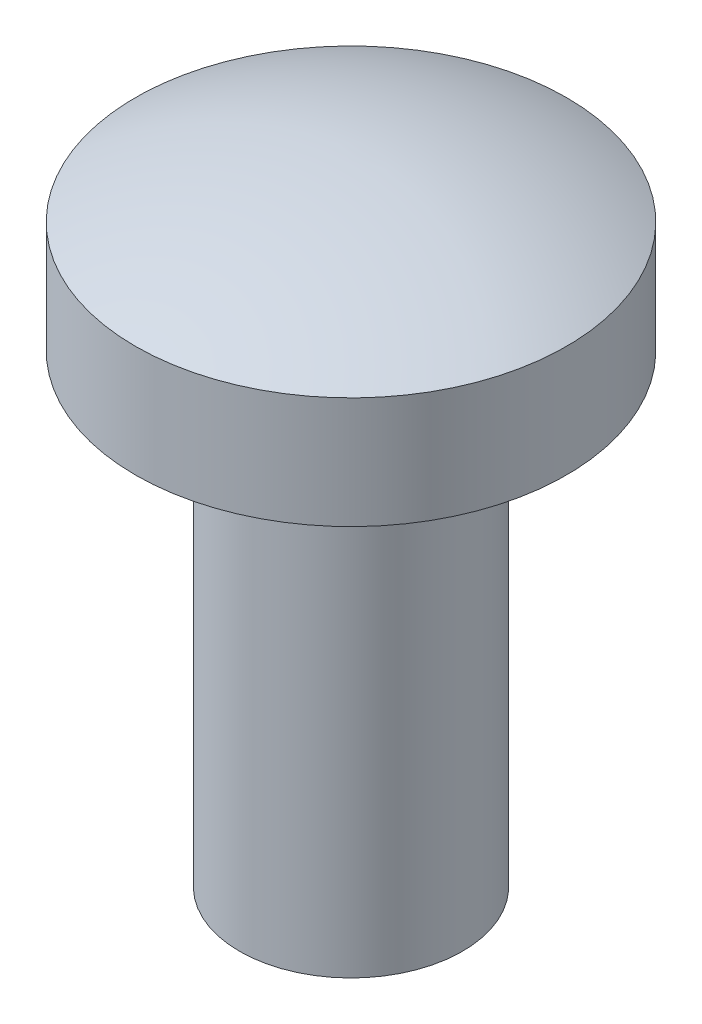
ISO-10303-21;
HEADER;
FILE_DESCRIPTION(('STEP AP214'),'2;1');
FILE_NAME('part.step','',(''),(''),'','','');
FILE_SCHEMA(('AUTOMOTIVE_DESIGN { 1 0 10303 214 1 1 1 1 }'));
ENDSEC;
DATA;
#1=APPLICATION_CONTEXT('core data for automotive mechanical design processes');
#2=APPLICATION_PROTOCOL_DEFINITION('international standard','automotive_design',2000,#1);
#3=PRODUCT_CONTEXT('',#1,'mechanical');
#4=PRODUCT('Part','Part','',(#3));
#5=PRODUCT_RELATED_PRODUCT_CATEGORY('part','',(#4));
#6=PRODUCT_DEFINITION_FORMATION('','',#4);
#7=PRODUCT_DEFINITION_CONTEXT('part definition',#1,'design');
#8=PRODUCT_DEFINITION('design','',#6,#7);
#9=PRODUCT_DEFINITION_SHAPE('','',#8);
#10=(LENGTH_UNIT() NAMED_UNIT(*) SI_UNIT(.MILLI.,.METRE.));
#11=(NAMED_UNIT(*) PLANE_ANGLE_UNIT() SI_UNIT($,.RADIAN.));
#12=(NAMED_UNIT(*) SI_UNIT($,.STERADIAN.) SOLID_ANGLE_UNIT());
#13=UNCERTAINTY_MEASURE_WITH_UNIT(LENGTH_MEASURE(1.E-05),#10,'distance_accuracy_value','');
#14=(GEOMETRIC_REPRESENTATION_CONTEXT(3) GLOBAL_UNCERTAINTY_ASSIGNED_CONTEXT((#13)) GLOBAL_UNIT_ASSIGNED_CONTEXT((#10,
#11,#12)) REPRESENTATION_CONTEXT('',''));
#15=CARTESIAN_POINT('',(0.,0.,0.));
#16=DIRECTION('',(0.,0.,1.));
#17=DIRECTION('',(1.,0.,0.));
#18=AXIS2_PLACEMENT_3D('',#15,#16,#17);
#19=CARTESIAN_POINT('',(0.,-3.175,0.));
#20=DIRECTION('',(0.,1.,0.));
#21=DIRECTION('',(0.,0.,1.));
#22=AXIS2_PLACEMENT_3D('',#19,#20,#21);
#23=PLANE('',#22);
#24=CARTESIAN_POINT('',(0.,-3.175,0.));
#25=DIRECTION('',(0.,1.,0.));
#26=DIRECTION('',(0.,0.,1.));
#27=AXIS2_PLACEMENT_3D('',#24,#25,#26);
#28=CIRCLE('',#27,0.761999999999996);
#29=CARTESIAN_POINT('',(0.,-3.175,0.761999999999983));
#30=VERTEX_POINT('',#29);
#31=EDGE_CURVE('E10',#30,#30,#28,.T.);
#32=ORIENTED_EDGE('',*,*,#31,.F.);
#33=EDGE_LOOP('',(#32));
#34=FACE_BOUND('',#33,.T.);
#35=ADVANCED_FACE('F30',(#34),#23,.F.);
#36=CARTESIAN_POINT('',(0.,64.9077037109984,0.));
#37=DIRECTION('',(0.,1.,0.));
#38=DIRECTION('',(0.,0.,1.));
#39=AXIS2_PLACEMENT_3D('',#36,#37,#38);
#40=CYLINDRICAL_SURFACE('',#39,0.761999999999996);
#41=CARTESIAN_POINT('',(0.,0.,0.));
#42=DIRECTION('',(0.,1.,0.));
#43=DIRECTION('',(0.,0.,1.));
#44=AXIS2_PLACEMENT_3D('',#41,#42,#43);
#45=CIRCLE('',#44,0.761999999999996);
#46=CARTESIAN_POINT('',(0.,0.,0.761999999999984));
#47=VERTEX_POINT('',#46);
#48=EDGE_CURVE('E36',#47,#47,#45,.T.);
#49=ORIENTED_EDGE('',*,*,#48,.F.);
#50=EDGE_LOOP('',(#49));
#51=FACE_BOUND('',#50,.T.);
#52=ORIENTED_EDGE('',*,*,#31,.T.);
#53=EDGE_LOOP('',(#52));
#54=FACE_BOUND('',#53,.T.);
#55=ADVANCED_FACE('F60',(#51,#54),#40,.T.);
#56=CARTESIAN_POINT('',(0.,0.,-0.762000000000008));
#57=DIRECTION('',(0.,1.,0.));
#58=DIRECTION('',(0.,0.,1.));
#59=AXIS2_PLACEMENT_3D('',#56,#57,#58);
#60=PLANE('',#59);
#61=CARTESIAN_POINT('',(0.,0.,0.));
#62=DIRECTION('',(0.,1.,0.));
#63=DIRECTION('',(0.,0.,1.));
#64=AXIS2_PLACEMENT_3D('',#61,#62,#63);
#65=CIRCLE('',#64,1.4732);
#66=CARTESIAN_POINT('',(0.,0.,1.47319999999998));
#67=VERTEX_POINT('',#66);
#68=EDGE_CURVE('E40',#67,#67,#65,.T.);
#69=ORIENTED_EDGE('',*,*,#68,.F.);
#70=EDGE_LOOP('',(#69));
#71=FACE_BOUND('',#70,.T.);
#72=ORIENTED_EDGE('',*,*,#48,.T.);
#73=EDGE_LOOP('',(#72));
#74=FACE_BOUND('',#73,.T.);
#75=ADVANCED_FACE('F55',(#71,#74),#60,.F.);
#76=CARTESIAN_POINT('',(0.,64.9077037109984,0.));
#77=DIRECTION('',(0.,1.,0.));
#78=DIRECTION('',(0.,0.,1.));
#79=AXIS2_PLACEMENT_3D('',#76,#77,#78);
#80=CYLINDRICAL_SURFACE('',#79,1.4732);
#81=CARTESIAN_POINT('',(0.,0.761999999999999,0.));
#82=DIRECTION('',(0.,1.,0.));
#83=DIRECTION('',(0.,0.,1.));
#84=AXIS2_PLACEMENT_3D('',#81,#82,#83);
#85=CIRCLE('',#84,1.4732);
#86=CARTESIAN_POINT('',(0.,0.761999999999998,1.47319999999998));
#87=VERTEX_POINT('',#86);
#88=EDGE_CURVE('E44',#87,#87,#85,.T.);
#89=ORIENTED_EDGE('',*,*,#88,.F.);
#90=EDGE_LOOP('',(#89));
#91=FACE_BOUND('',#90,.T.);
#92=ORIENTED_EDGE('',*,*,#68,.T.);
#93=EDGE_LOOP('',(#92));
#94=FACE_BOUND('',#93,.T.);
#95=ADVANCED_FACE('F52',(#91,#94),#80,.T.);
#96=CARTESIAN_POINT('',(0.,-2.11182857142857,0.));
#97=DIRECTION('',(0.,1.,0.));
#98=DIRECTION('',(0.,0.,-1.));
#99=AXIS2_PLACEMENT_3D('',#96,#97,#98);
#100=SPHERICAL_SURFACE('',#99,3.22942857142857);
#101=ORIENTED_EDGE('',*,*,#88,.T.);
#102=EDGE_LOOP('',(#101));
#103=FACE_BOUND('',#102,.T.);
#104=ADVANCED_FACE('F50',(#103),#100,.T.);
#105=CLOSED_SHELL('',(#35,#55,#75,#95,#104));
#106=MANIFOLD_SOLID_BREP('B2',#105);
#107=ADVANCED_BREP_SHAPE_REPRESENTATION('',(#18,#106),#14);
#108=SHAPE_DEFINITION_REPRESENTATION(#9,#107);
ENDSEC;
END-ISO-10303-21;
